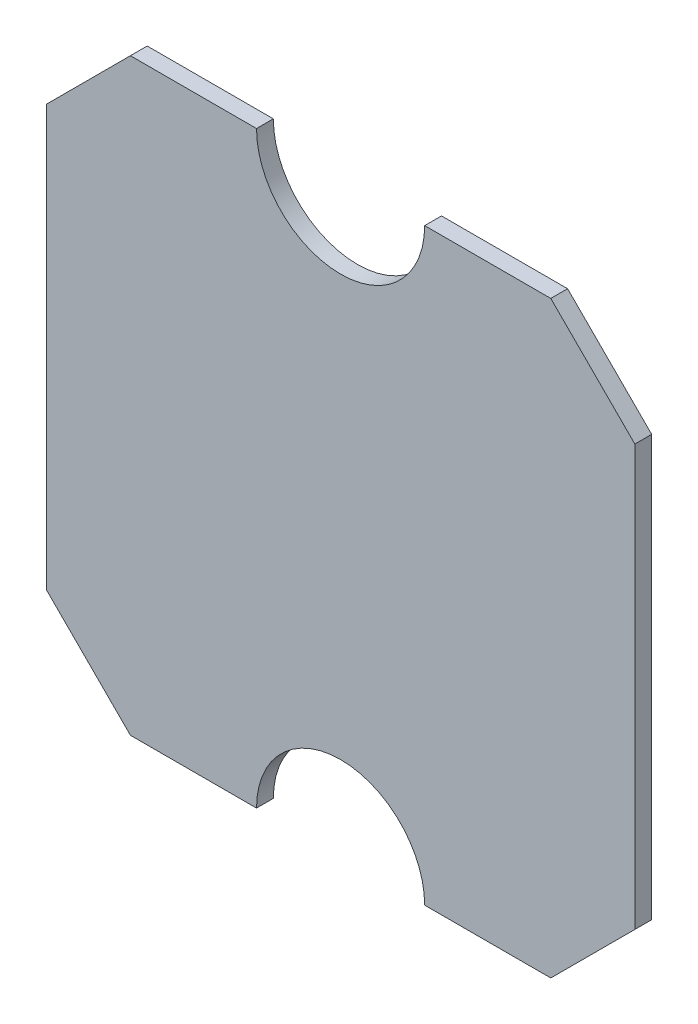
ISO-10303-21;
HEADER;
FILE_DESCRIPTION(('STEP AP214'),'2;1');
FILE_NAME('part.step','',(''),(''),'','','');
FILE_SCHEMA(('AUTOMOTIVE_DESIGN { 1 0 10303 214 1 1 1 1 }'));
ENDSEC;
DATA;
#1=APPLICATION_CONTEXT('core data for automotive mechanical design processes');
#2=APPLICATION_PROTOCOL_DEFINITION('international standard','automotive_design',2000,#1);
#3=PRODUCT_CONTEXT('',#1,'mechanical');
#4=PRODUCT('Part','Part','',(#3));
#5=PRODUCT_RELATED_PRODUCT_CATEGORY('part','',(#4));
#6=PRODUCT_DEFINITION_FORMATION('','',#4);
#7=PRODUCT_DEFINITION_CONTEXT('part definition',#1,'design');
#8=PRODUCT_DEFINITION('design','',#6,#7);
#9=PRODUCT_DEFINITION_SHAPE('','',#8);
#10=(LENGTH_UNIT() NAMED_UNIT(*) SI_UNIT(.MILLI.,.METRE.));
#11=(NAMED_UNIT(*) PLANE_ANGLE_UNIT() SI_UNIT($,.RADIAN.));
#12=(NAMED_UNIT(*) SI_UNIT($,.STERADIAN.) SOLID_ANGLE_UNIT());
#13=UNCERTAINTY_MEASURE_WITH_UNIT(LENGTH_MEASURE(1.E-05),#10,'distance_accuracy_value','');
#14=(GEOMETRIC_REPRESENTATION_CONTEXT(3) GLOBAL_UNCERTAINTY_ASSIGNED_CONTEXT((#13)) GLOBAL_UNIT_ASSIGNED_CONTEXT((#10,
#11,#12)) REPRESENTATION_CONTEXT('',''));
#15=CARTESIAN_POINT('',(0.,0.,0.));
#16=DIRECTION('',(0.,0.,1.));
#17=DIRECTION('',(1.,0.,0.));
#18=AXIS2_PLACEMENT_3D('',#15,#16,#17);
#19=CARTESIAN_POINT('',(175.,125.,5.));
#20=DIRECTION('',(-0.707106781186548,-0.707106781186547,0.));
#21=DIRECTION('',(0.707106781186547,-0.707106781186548,0.));
#22=AXIS2_PLACEMENT_3D('',#19,#20,#21);
#23=PLANE('',#22);
#24=DIRECTION('',(-0.707106781186547,0.707106781186548,0.));
#25=VECTOR('',#24,1.);
#26=CARTESIAN_POINT('',(175.,125.,-5.));
#27=LINE('',#26,#25);
#28=CARTESIAN_POINT('',(175.,125.,-5.));
#29=VERTEX_POINT('',#28);
#30=CARTESIAN_POINT('',(125.,175.,-5.));
#31=VERTEX_POINT('',#30);
#32=EDGE_CURVE('E170',#29,#31,#27,.T.);
#33=ORIENTED_EDGE('',*,*,#32,.T.);
#34=DIRECTION('',(0.,0.,-1.));
#35=VECTOR('',#34,1.);
#36=CARTESIAN_POINT('',(125.,175.,5.));
#37=LINE('',#36,#35);
#38=CARTESIAN_POINT('',(125.,175.,5.));
#39=VERTEX_POINT('',#38);
#40=EDGE_CURVE('E11',#39,#31,#37,.T.);
#41=ORIENTED_EDGE('',*,*,#40,.F.);
#42=DIRECTION('',(-0.707106781186547,0.707106781186548,0.));
#43=VECTOR('',#42,1.);
#44=CARTESIAN_POINT('',(175.,125.,5.));
#45=LINE('',#44,#43);
#46=CARTESIAN_POINT('',(175.,125.,5.));
#47=VERTEX_POINT('',#46);
#48=EDGE_CURVE('E204',#47,#39,#45,.T.);
#49=ORIENTED_EDGE('',*,*,#48,.F.);
#50=DIRECTION('',(0.,0.,-1.));
#51=VECTOR('',#50,1.);
#52=CARTESIAN_POINT('',(175.,125.,5.));
#53=LINE('',#52,#51);
#54=EDGE_CURVE('E166',#47,#29,#53,.T.);
#55=ORIENTED_EDGE('',*,*,#54,.T.);
#56=EDGE_LOOP('',(#33,#41,#49,#55));
#57=FACE_BOUND('',#56,.T.);
#58=ADVANCED_FACE('F45',(#57),#23,.F.);
#59=CARTESIAN_POINT('',(125.,175.,5.));
#60=DIRECTION('',(0.,-1.,0.));
#61=DIRECTION('',(0.,0.,-1.));
#62=AXIS2_PLACEMENT_3D('',#59,#60,#61);
#63=PLANE('',#62);
#64=DIRECTION('',(-1.,0.,0.));
#65=VECTOR('',#64,1.);
#66=CARTESIAN_POINT('',(125.,175.,-5.));
#67=LINE('',#66,#65);
#68=CARTESIAN_POINT('',(50.,175.,-5.));
#69=VERTEX_POINT('',#68);
#70=EDGE_CURVE('E174',#31,#69,#67,.T.);
#71=ORIENTED_EDGE('',*,*,#70,.T.);
#72=DIRECTION('',(0.,0.,-1.));
#73=VECTOR('',#72,1.);
#74=CARTESIAN_POINT('',(50.,175.,5.));
#75=LINE('',#74,#73);
#76=CARTESIAN_POINT('',(50.,175.,5.));
#77=VERTEX_POINT('',#76);
#78=EDGE_CURVE('E54',#77,#69,#75,.T.);
#79=ORIENTED_EDGE('',*,*,#78,.F.);
#80=DIRECTION('',(-1.,0.,0.));
#81=VECTOR('',#80,1.);
#82=CARTESIAN_POINT('',(125.,175.,5.));
#83=LINE('',#82,#81);
#84=EDGE_CURVE('E117',#39,#77,#83,.T.);
#85=ORIENTED_EDGE('',*,*,#84,.F.);
#86=ORIENTED_EDGE('',*,*,#40,.T.);
#87=EDGE_LOOP('',(#71,#79,#85,#86));
#88=FACE_BOUND('',#87,.T.);
#89=ADVANCED_FACE('F298',(#88),#63,.F.);
#90=CARTESIAN_POINT('',(0.,175.,5.));
#91=DIRECTION('',(0.,0.,-1.));
#92=DIRECTION('',(-1.,0.,0.));
#93=AXIS2_PLACEMENT_3D('',#90,#91,#92);
#94=CYLINDRICAL_SURFACE('',#93,50.);
#95=CARTESIAN_POINT('',(0.,175.,-5.));
#96=DIRECTION('',(0.,0.,-1.));
#97=DIRECTION('',(-1.,0.,0.));
#98=AXIS2_PLACEMENT_3D('',#95,#96,#97);
#99=CIRCLE('',#98,50.);
#100=CARTESIAN_POINT('',(-50.,175.,-5.));
#101=VERTEX_POINT('',#100);
#102=EDGE_CURVE('E177',#69,#101,#99,.T.);
#103=ORIENTED_EDGE('',*,*,#102,.T.);
#104=DIRECTION('',(0.,0.,-1.));
#105=VECTOR('',#104,1.);
#106=CARTESIAN_POINT('',(-50.,175.,5.));
#107=LINE('',#106,#105);
#108=CARTESIAN_POINT('',(-50.,175.,5.));
#109=VERTEX_POINT('',#108);
#110=EDGE_CURVE('E231',#109,#101,#107,.T.);
#111=ORIENTED_EDGE('',*,*,#110,.F.);
#112=CARTESIAN_POINT('',(0.,175.,5.));
#113=DIRECTION('',(0.,0.,-1.));
#114=DIRECTION('',(-1.,0.,0.));
#115=AXIS2_PLACEMENT_3D('',#112,#113,#114);
#116=CIRCLE('',#115,50.);
#117=EDGE_CURVE('E241',#77,#109,#116,.T.);
#118=ORIENTED_EDGE('',*,*,#117,.F.);
#119=ORIENTED_EDGE('',*,*,#78,.T.);
#120=EDGE_LOOP('',(#103,#111,#118,#119));
#121=FACE_BOUND('',#120,.T.);
#122=ADVANCED_FACE('F239',(#121),#94,.F.);
#123=CARTESIAN_POINT('',(-125.,175.,5.));
#124=DIRECTION('',(0.,-1.,0.));
#125=DIRECTION('',(0.,0.,-1.));
#126=AXIS2_PLACEMENT_3D('',#123,#124,#125);
#127=PLANE('',#126);
#128=DIRECTION('',(-1.,0.,0.));
#129=VECTOR('',#128,1.);
#130=CARTESIAN_POINT('',(-125.,175.,-5.));
#131=LINE('',#130,#129);
#132=CARTESIAN_POINT('',(-125.,175.,-5.));
#133=VERTEX_POINT('',#132);
#134=EDGE_CURVE('E180',#101,#133,#131,.T.);
#135=ORIENTED_EDGE('',*,*,#134,.T.);
#136=DIRECTION('',(0.,0.,-1.));
#137=VECTOR('',#136,1.);
#138=CARTESIAN_POINT('',(-125.,175.,5.));
#139=LINE('',#138,#137);
#140=CARTESIAN_POINT('',(-125.,175.,5.));
#141=VERTEX_POINT('',#140);
#142=EDGE_CURVE('E227',#141,#133,#139,.T.);
#143=ORIENTED_EDGE('',*,*,#142,.F.);
#144=DIRECTION('',(-1.,0.,0.));
#145=VECTOR('',#144,1.);
#146=CARTESIAN_POINT('',(-125.,175.,5.));
#147=LINE('',#146,#145);
#148=EDGE_CURVE('E260',#109,#141,#147,.T.);
#149=ORIENTED_EDGE('',*,*,#148,.F.);
#150=ORIENTED_EDGE('',*,*,#110,.T.);
#151=EDGE_LOOP('',(#135,#143,#149,#150));
#152=FACE_BOUND('',#151,.T.);
#153=ADVANCED_FACE('F250',(#152),#127,.F.);
#154=CARTESIAN_POINT('',(-175.,125.,5.));
#155=DIRECTION('',(0.707106781186548,-0.707106781186547,0.));
#156=DIRECTION('',(0.707106781186547,0.707106781186548,0.));
#157=AXIS2_PLACEMENT_3D('',#154,#155,#156);
#158=PLANE('',#157);
#159=DIRECTION('',(-0.707106781186547,-0.707106781186548,0.));
#160=VECTOR('',#159,1.);
#161=CARTESIAN_POINT('',(-175.,125.,-5.));
#162=LINE('',#161,#160);
#163=CARTESIAN_POINT('',(-175.,125.,-5.));
#164=VERTEX_POINT('',#163);
#165=EDGE_CURVE('E183',#133,#164,#162,.T.);
#166=ORIENTED_EDGE('',*,*,#165,.T.);
#167=DIRECTION('',(0.,0.,-1.));
#168=VECTOR('',#167,1.);
#169=CARTESIAN_POINT('',(-175.,125.,5.));
#170=LINE('',#169,#168);
#171=CARTESIAN_POINT('',(-175.,125.,5.));
#172=VERTEX_POINT('',#171);
#173=EDGE_CURVE('E223',#172,#164,#170,.T.);
#174=ORIENTED_EDGE('',*,*,#173,.F.);
#175=DIRECTION('',(-0.707106781186547,-0.707106781186548,0.));
#176=VECTOR('',#175,1.);
#177=CARTESIAN_POINT('',(-175.,125.,5.));
#178=LINE('',#177,#176);
#179=EDGE_CURVE('E256',#141,#172,#178,.T.);
#180=ORIENTED_EDGE('',*,*,#179,.F.);
#181=ORIENTED_EDGE('',*,*,#142,.T.);
#182=EDGE_LOOP('',(#166,#174,#180,#181));
#183=FACE_BOUND('',#182,.T.);
#184=ADVANCED_FACE('F254',(#183),#158,.F.);
#185=CARTESIAN_POINT('',(-175.,125.,5.));
#186=DIRECTION('',(1.,0.,0.));
#187=DIRECTION('',(0.,1.,0.));
#188=AXIS2_PLACEMENT_3D('',#185,#186,#187);
#189=PLANE('',#188);
#190=DIRECTION('',(0.,-1.,0.));
#191=VECTOR('',#190,1.);
#192=CARTESIAN_POINT('',(-175.,125.,-5.));
#193=LINE('',#192,#191);
#194=CARTESIAN_POINT('',(-175.,-125.,-5.));
#195=VERTEX_POINT('',#194);
#196=EDGE_CURVE('E186',#164,#195,#193,.T.);
#197=ORIENTED_EDGE('',*,*,#196,.T.);
#198=DIRECTION('',(0.,0.,-1.));
#199=VECTOR('',#198,1.);
#200=CARTESIAN_POINT('',(-175.,-125.,5.));
#201=LINE('',#200,#199);
#202=CARTESIAN_POINT('',(-175.,-125.,5.));
#203=VERTEX_POINT('',#202);
#204=EDGE_CURVE('E219',#203,#195,#201,.T.);
#205=ORIENTED_EDGE('',*,*,#204,.F.);
#206=DIRECTION('',(0.,-1.,0.));
#207=VECTOR('',#206,1.);
#208=CARTESIAN_POINT('',(-175.,125.,5.));
#209=LINE('',#208,#207);
#210=EDGE_CURVE('E259',#172,#203,#209,.T.);
#211=ORIENTED_EDGE('',*,*,#210,.F.);
#212=ORIENTED_EDGE('',*,*,#173,.T.);
#213=EDGE_LOOP('',(#197,#205,#211,#212));
#214=FACE_BOUND('',#213,.T.);
#215=ADVANCED_FACE('F311',(#214),#189,.F.);
#216=CARTESIAN_POINT('',(-175.,-125.,5.));
#217=DIRECTION('',(0.707106781186547,0.707106781186548,0.));
#218=DIRECTION('',(-0.707106781186548,0.707106781186547,0.));
#219=AXIS2_PLACEMENT_3D('',#216,#217,#218);
#220=PLANE('',#219);
#221=DIRECTION('',(0.707106781186548,-0.707106781186547,0.));
#222=VECTOR('',#221,1.);
#223=CARTESIAN_POINT('',(-175.,-125.,-5.));
#224=LINE('',#223,#222);
#225=CARTESIAN_POINT('',(-125.,-175.,-5.));
#226=VERTEX_POINT('',#225);
#227=EDGE_CURVE('E189',#195,#226,#224,.T.);
#228=ORIENTED_EDGE('',*,*,#227,.T.);
#229=DIRECTION('',(0.,0.,-1.));
#230=VECTOR('',#229,1.);
#231=CARTESIAN_POINT('',(-125.,-175.,5.));
#232=LINE('',#231,#230);
#233=CARTESIAN_POINT('',(-125.,-175.,5.));
#234=VERTEX_POINT('',#233);
#235=EDGE_CURVE('E215',#234,#226,#232,.T.);
#236=ORIENTED_EDGE('',*,*,#235,.F.);
#237=DIRECTION('',(0.707106781186548,-0.707106781186547,0.));
#238=VECTOR('',#237,1.);
#239=CARTESIAN_POINT('',(-175.,-125.,5.));
#240=LINE('',#239,#238);
#241=EDGE_CURVE('E264',#203,#234,#240,.T.);
#242=ORIENTED_EDGE('',*,*,#241,.F.);
#243=ORIENTED_EDGE('',*,*,#204,.T.);
#244=EDGE_LOOP('',(#228,#236,#242,#243));
#245=FACE_BOUND('',#244,.T.);
#246=ADVANCED_FACE('F314',(#245),#220,.F.);
#247=CARTESIAN_POINT('',(-125.,-175.,5.));
#248=DIRECTION('',(0.,1.,0.));
#249=DIRECTION('',(-1.,0.,0.));
#250=AXIS2_PLACEMENT_3D('',#247,#248,#249);
#251=PLANE('',#250);
#252=DIRECTION('',(1.,0.,0.));
#253=VECTOR('',#252,1.);
#254=CARTESIAN_POINT('',(-125.,-175.,-5.));
#255=LINE('',#254,#253);
#256=CARTESIAN_POINT('',(-49.9999999999999,-175.,-5.));
#257=VERTEX_POINT('',#256);
#258=EDGE_CURVE('E192',#226,#257,#255,.T.);
#259=ORIENTED_EDGE('',*,*,#258,.T.);
#260=DIRECTION('',(0.,0.,-1.));
#261=VECTOR('',#260,1.);
#262=CARTESIAN_POINT('',(-49.9999999999999,-175.,5.));
#263=LINE('',#262,#261);
#264=CARTESIAN_POINT('',(-49.9999999999999,-175.,5.));
#265=VERTEX_POINT('',#264);
#266=EDGE_CURVE('E211',#265,#257,#263,.T.);
#267=ORIENTED_EDGE('',*,*,#266,.F.);
#268=DIRECTION('',(1.,0.,0.));
#269=VECTOR('',#268,1.);
#270=CARTESIAN_POINT('',(-125.,-175.,5.));
#271=LINE('',#270,#269);
#272=EDGE_CURVE('E271',#234,#265,#271,.T.);
#273=ORIENTED_EDGE('',*,*,#272,.F.);
#274=ORIENTED_EDGE('',*,*,#235,.T.);
#275=EDGE_LOOP('',(#259,#267,#273,#274));
#276=FACE_BOUND('',#275,.T.);
#277=ADVANCED_FACE('F279',(#276),#251,.F.);
#278=CARTESIAN_POINT('',(0.,-175.,5.));
#279=DIRECTION('',(0.,0.,-1.));
#280=DIRECTION('',(-1.,0.,0.));
#281=AXIS2_PLACEMENT_3D('',#278,#279,#280);
#282=CYLINDRICAL_SURFACE('',#281,50.);
#283=CARTESIAN_POINT('',(0.,-175.,-5.));
#284=DIRECTION('',(0.,0.,-1.));
#285=DIRECTION('',(1.,0.,0.));
#286=AXIS2_PLACEMENT_3D('',#283,#284,#285);
#287=CIRCLE('',#286,50.);
#288=CARTESIAN_POINT('',(50.0000000000001,-175.,-5.));
#289=VERTEX_POINT('',#288);
#290=EDGE_CURVE('E195',#257,#289,#287,.T.);
#291=ORIENTED_EDGE('',*,*,#290,.T.);
#292=DIRECTION('',(0.,0.,-1.));
#293=VECTOR('',#292,1.);
#294=CARTESIAN_POINT('',(50.0000000000001,-175.,5.));
#295=LINE('',#294,#293);
#296=CARTESIAN_POINT('',(50.0000000000001,-175.,5.));
#297=VERTEX_POINT('',#296);
#298=EDGE_CURVE('E159',#297,#289,#295,.T.);
#299=ORIENTED_EDGE('',*,*,#298,.F.);
#300=CARTESIAN_POINT('',(0.,-175.,5.));
#301=DIRECTION('',(0.,0.,-1.));
#302=DIRECTION('',(1.,0.,0.));
#303=AXIS2_PLACEMENT_3D('',#300,#301,#302);
#304=CIRCLE('',#303,50.);
#305=EDGE_CURVE('E148',#265,#297,#304,.T.);
#306=ORIENTED_EDGE('',*,*,#305,.F.);
#307=ORIENTED_EDGE('',*,*,#266,.T.);
#308=EDGE_LOOP('',(#291,#299,#306,#307));
#309=FACE_BOUND('',#308,.T.);
#310=ADVANCED_FACE('F283',(#309),#282,.F.);
#311=CARTESIAN_POINT('',(125.,-175.,5.));
#312=DIRECTION('',(0.,1.,0.));
#313=DIRECTION('',(-1.,0.,0.));
#314=AXIS2_PLACEMENT_3D('',#311,#312,#313);
#315=PLANE('',#314);
#316=DIRECTION('',(1.,0.,0.));
#317=VECTOR('',#316,1.);
#318=CARTESIAN_POINT('',(125.,-175.,-5.));
#319=LINE('',#318,#317);
#320=CARTESIAN_POINT('',(125.,-175.,-5.));
#321=VERTEX_POINT('',#320);
#322=EDGE_CURVE('E157',#289,#321,#319,.T.);
#323=ORIENTED_EDGE('',*,*,#322,.T.);
#324=DIRECTION('',(0.,0.,-1.));
#325=VECTOR('',#324,1.);
#326=CARTESIAN_POINT('',(125.,-175.,5.));
#327=LINE('',#326,#325);
#328=CARTESIAN_POINT('',(125.,-175.,5.));
#329=VERTEX_POINT('',#328);
#330=EDGE_CURVE('E154',#329,#321,#327,.T.);
#331=ORIENTED_EDGE('',*,*,#330,.F.);
#332=DIRECTION('',(1.,0.,0.));
#333=VECTOR('',#332,1.);
#334=CARTESIAN_POINT('',(125.,-175.,5.));
#335=LINE('',#334,#333);
#336=EDGE_CURVE('E142',#297,#329,#335,.T.);
#337=ORIENTED_EDGE('',*,*,#336,.F.);
#338=ORIENTED_EDGE('',*,*,#298,.T.);
#339=EDGE_LOOP('',(#323,#331,#337,#338));
#340=FACE_BOUND('',#339,.T.);
#341=ADVANCED_FACE('F155',(#340),#315,.F.);
#342=CARTESIAN_POINT('',(175.,-125.,5.));
#343=DIRECTION('',(-0.707106781186547,0.707106781186548,0.));
#344=DIRECTION('',(-0.707106781186548,-0.707106781186547,0.));
#345=AXIS2_PLACEMENT_3D('',#342,#343,#344);
#346=PLANE('',#345);
#347=DIRECTION('',(0.707106781186548,0.707106781186547,0.));
#348=VECTOR('',#347,1.);
#349=CARTESIAN_POINT('',(175.,-125.,-5.));
#350=LINE('',#349,#348);
#351=CARTESIAN_POINT('',(175.,-125.,-5.));
#352=VERTEX_POINT('',#351);
#353=EDGE_CURVE('E103',#321,#352,#350,.T.);
#354=ORIENTED_EDGE('',*,*,#353,.T.);
#355=DIRECTION('',(0.,0.,-1.));
#356=VECTOR('',#355,1.);
#357=CARTESIAN_POINT('',(175.,-125.,5.));
#358=LINE('',#357,#356);
#359=CARTESIAN_POINT('',(175.,-125.,5.));
#360=VERTEX_POINT('',#359);
#361=EDGE_CURVE('E160',#360,#352,#358,.T.);
#362=ORIENTED_EDGE('',*,*,#361,.F.);
#363=DIRECTION('',(0.707106781186548,0.707106781186547,0.));
#364=VECTOR('',#363,1.);
#365=CARTESIAN_POINT('',(175.,-125.,5.));
#366=LINE('',#365,#364);
#367=EDGE_CURVE('E146',#329,#360,#366,.T.);
#368=ORIENTED_EDGE('',*,*,#367,.F.);
#369=ORIENTED_EDGE('',*,*,#330,.T.);
#370=EDGE_LOOP('',(#354,#362,#368,#369));
#371=FACE_BOUND('',#370,.T.);
#372=ADVANCED_FACE('F162',(#371),#346,.F.);
#373=CARTESIAN_POINT('',(175.,125.,5.));
#374=DIRECTION('',(-1.,0.,0.));
#375=DIRECTION('',(0.,-1.,0.));
#376=AXIS2_PLACEMENT_3D('',#373,#374,#375);
#377=PLANE('',#376);
#378=DIRECTION('',(0.,1.,0.));
#379=VECTOR('',#378,1.);
#380=CARTESIAN_POINT('',(175.,125.,-5.));
#381=LINE('',#380,#379);
#382=EDGE_CURVE('E109',#352,#29,#381,.T.);
#383=ORIENTED_EDGE('',*,*,#382,.T.);
#384=ORIENTED_EDGE('',*,*,#54,.F.);
#385=DIRECTION('',(0.,1.,0.));
#386=VECTOR('',#385,1.);
#387=CARTESIAN_POINT('',(175.,125.,5.));
#388=LINE('',#387,#386);
#389=EDGE_CURVE('E62',#360,#47,#388,.T.);
#390=ORIENTED_EDGE('',*,*,#389,.F.);
#391=ORIENTED_EDGE('',*,*,#361,.T.);
#392=EDGE_LOOP('',(#383,#384,#390,#391));
#393=FACE_BOUND('',#392,.T.);
#394=ADVANCED_FACE('F287',(#393),#377,.F.);
#395=CARTESIAN_POINT('',(0.,175.,5.));
#396=DIRECTION('',(0.,0.,-1.));
#397=DIRECTION('',(-1.,0.,0.));
#398=AXIS2_PLACEMENT_3D('',#395,#396,#397);
#399=PLANE('',#398);
#400=ORIENTED_EDGE('',*,*,#48,.T.);
#401=ORIENTED_EDGE('',*,*,#84,.T.);
#402=ORIENTED_EDGE('',*,*,#117,.T.);
#403=ORIENTED_EDGE('',*,*,#148,.T.);
#404=ORIENTED_EDGE('',*,*,#179,.T.);
#405=ORIENTED_EDGE('',*,*,#210,.T.);
#406=ORIENTED_EDGE('',*,*,#241,.T.);
#407=ORIENTED_EDGE('',*,*,#272,.T.);
#408=ORIENTED_EDGE('',*,*,#305,.T.);
#409=ORIENTED_EDGE('',*,*,#336,.T.);
#410=ORIENTED_EDGE('',*,*,#367,.T.);
#411=ORIENTED_EDGE('',*,*,#389,.T.);
#412=EDGE_LOOP('',(#400,#401,#402,#403,#404,#405,#406,#407,#408,#409,#410,#411));
#413=FACE_BOUND('',#412,.T.);
#414=ADVANCED_FACE('F144',(#413),#399,.F.);
#415=CARTESIAN_POINT('',(0.,175.,-5.));
#416=DIRECTION('',(0.,0.,-1.));
#417=DIRECTION('',(-1.,0.,0.));
#418=AXIS2_PLACEMENT_3D('',#415,#416,#417);
#419=PLANE('',#418);
#420=ORIENTED_EDGE('',*,*,#32,.F.);
#421=ORIENTED_EDGE('',*,*,#382,.F.);
#422=ORIENTED_EDGE('',*,*,#353,.F.);
#423=ORIENTED_EDGE('',*,*,#322,.F.);
#424=ORIENTED_EDGE('',*,*,#290,.F.);
#425=ORIENTED_EDGE('',*,*,#258,.F.);
#426=ORIENTED_EDGE('',*,*,#227,.F.);
#427=ORIENTED_EDGE('',*,*,#196,.F.);
#428=ORIENTED_EDGE('',*,*,#165,.F.);
#429=ORIENTED_EDGE('',*,*,#134,.F.);
#430=ORIENTED_EDGE('',*,*,#102,.F.);
#431=ORIENTED_EDGE('',*,*,#70,.F.);
#432=EDGE_LOOP('',(#420,#421,#422,#423,#424,#425,#426,#427,#428,#429,#430,#431));
#433=FACE_BOUND('',#432,.T.);
#434=ADVANCED_FACE('F245',(#433),#419,.T.);
#435=CLOSED_SHELL('',(#58,#89,#122,#153,#184,#215,#246,#277,#310,#341,#372,#394,#414,#434));
#436=MANIFOLD_SOLID_BREP('B2',#435);
#437=ADVANCED_BREP_SHAPE_REPRESENTATION('',(#18,#436),#14);
#438=SHAPE_DEFINITION_REPRESENTATION(#9,#437);
ENDSEC;
END-ISO-10303-21;
